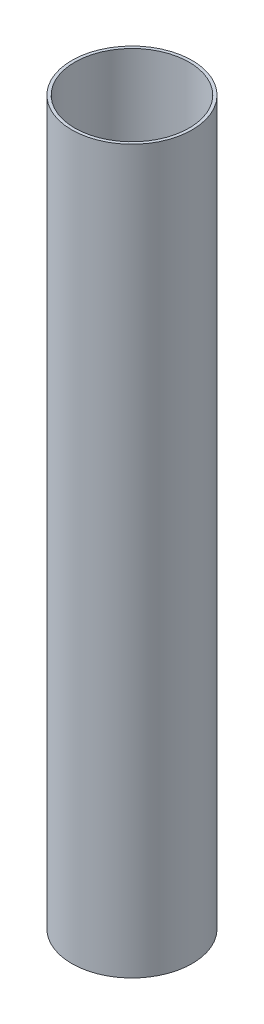
ISO-10303-21;
HEADER;
FILE_DESCRIPTION(('STEP AP214'),'2;1');
FILE_NAME('part.step','',(''),(''),'','','');
FILE_SCHEMA(('AUTOMOTIVE_DESIGN { 1 0 10303 214 1 1 1 1 }'));
ENDSEC;
DATA;
#1=APPLICATION_CONTEXT('core data for automotive mechanical design processes');
#2=APPLICATION_PROTOCOL_DEFINITION('international standard','automotive_design',2000,#1);
#3=PRODUCT_CONTEXT('',#1,'mechanical');
#4=PRODUCT('Part','Part','',(#3));
#5=PRODUCT_RELATED_PRODUCT_CATEGORY('part','',(#4));
#6=PRODUCT_DEFINITION_FORMATION('','',#4);
#7=PRODUCT_DEFINITION_CONTEXT('part definition',#1,'design');
#8=PRODUCT_DEFINITION('design','',#6,#7);
#9=PRODUCT_DEFINITION_SHAPE('','',#8);
#10=(LENGTH_UNIT() NAMED_UNIT(*) SI_UNIT(.MILLI.,.METRE.));
#11=(NAMED_UNIT(*) PLANE_ANGLE_UNIT() SI_UNIT($,.RADIAN.));
#12=(NAMED_UNIT(*) SI_UNIT($,.STERADIAN.) SOLID_ANGLE_UNIT());
#13=UNCERTAINTY_MEASURE_WITH_UNIT(LENGTH_MEASURE(1.E-05),#10,'distance_accuracy_value','');
#14=(GEOMETRIC_REPRESENTATION_CONTEXT(3) GLOBAL_UNCERTAINTY_ASSIGNED_CONTEXT((#13)) GLOBAL_UNIT_ASSIGNED_CONTEXT((#10,
#11,#12)) REPRESENTATION_CONTEXT('',''));
#15=CARTESIAN_POINT('',(0.,0.,0.));
#16=DIRECTION('',(0.,0.,1.));
#17=DIRECTION('',(1.,0.,0.));
#18=AXIS2_PLACEMENT_3D('',#15,#16,#17);
#19=CARTESIAN_POINT('',(-60.3250000000002,762.,0.));
#20=DIRECTION('',(0.,1.,0.));
#21=DIRECTION('',(0.,0.,1.));
#22=AXIS2_PLACEMENT_3D('',#19,#20,#21);
#23=PLANE('',#22);
#24=CARTESIAN_POINT('',(0.,762.,0.));
#25=DIRECTION('',(0.,1.,0.));
#26=DIRECTION('',(0.,0.,1.));
#27=AXIS2_PLACEMENT_3D('',#24,#25,#26);
#28=CIRCLE('',#27,63.5000000000002);
#29=CARTESIAN_POINT('',(0.,762.,63.5000000000002));
#30=VERTEX_POINT('',#29);
#31=EDGE_CURVE('E49',#30,#30,#28,.T.);
#32=ORIENTED_EDGE('',*,*,#31,.T.);
#33=EDGE_LOOP('',(#32));
#34=FACE_BOUND('',#33,.T.);
#35=CARTESIAN_POINT('',(0.,762.,0.));
#36=DIRECTION('',(0.,1.,0.));
#37=DIRECTION('',(0.,0.,1.));
#38=AXIS2_PLACEMENT_3D('',#35,#36,#37);
#39=CIRCLE('',#38,60.3250000000002);
#40=CARTESIAN_POINT('',(0.,762.,60.3250000000002));
#41=VERTEX_POINT('',#40);
#42=EDGE_CURVE('E10',#41,#41,#39,.T.);
#43=ORIENTED_EDGE('',*,*,#42,.F.);
#44=EDGE_LOOP('',(#43));
#45=FACE_BOUND('',#44,.T.);
#46=ADVANCED_FACE('F35',(#34,#45),#23,.T.);
#47=CARTESIAN_POINT('',(0.,819.187021794204,0.));
#48=DIRECTION('',(0.,1.,0.));
#49=DIRECTION('',(0.,0.,1.));
#50=AXIS2_PLACEMENT_3D('',#47,#48,#49);
#51=CYLINDRICAL_SURFACE('',#50,60.3250000000001);
#52=ORIENTED_EDGE('',*,*,#42,.T.);
#53=EDGE_LOOP('',(#52));
#54=FACE_BOUND('',#53,.T.);
#55=CARTESIAN_POINT('',(0.,0.,0.));
#56=DIRECTION('',(0.,1.,0.));
#57=DIRECTION('',(0.,0.,1.));
#58=AXIS2_PLACEMENT_3D('',#55,#56,#57);
#59=CIRCLE('',#58,60.3250000000001);
#60=CARTESIAN_POINT('',(0.,0.,60.3250000000001));
#61=VERTEX_POINT('',#60);
#62=EDGE_CURVE('E41',#61,#61,#59,.T.);
#63=ORIENTED_EDGE('',*,*,#62,.F.);
#64=EDGE_LOOP('',(#63));
#65=FACE_BOUND('',#64,.T.);
#66=ADVANCED_FACE('F65',(#54,#65),#51,.F.);
#67=CARTESIAN_POINT('',(-60.3250000000001,0.,0.));
#68=DIRECTION('',(0.,-1.,0.));
#69=DIRECTION('',(0.,0.,-1.));
#70=AXIS2_PLACEMENT_3D('',#67,#68,#69);
#71=PLANE('',#70);
#72=ORIENTED_EDGE('',*,*,#62,.T.);
#73=EDGE_LOOP('',(#72));
#74=FACE_BOUND('',#73,.T.);
#75=CARTESIAN_POINT('',(0.,0.,0.));
#76=DIRECTION('',(0.,1.,0.));
#77=DIRECTION('',(0.,0.,1.));
#78=AXIS2_PLACEMENT_3D('',#75,#76,#77);
#79=CIRCLE('',#78,63.5);
#80=CARTESIAN_POINT('',(0.,0.,63.5));
#81=VERTEX_POINT('',#80);
#82=EDGE_CURVE('E45',#81,#81,#79,.T.);
#83=ORIENTED_EDGE('',*,*,#82,.F.);
#84=EDGE_LOOP('',(#83));
#85=FACE_BOUND('',#84,.T.);
#86=ADVANCED_FACE('F59',(#74,#85),#71,.T.);
#87=CARTESIAN_POINT('',(0.,819.187021794204,0.));
#88=DIRECTION('',(0.,1.,0.));
#89=DIRECTION('',(0.,0.,1.));
#90=AXIS2_PLACEMENT_3D('',#87,#88,#89);
#91=CYLINDRICAL_SURFACE('',#90,63.5000000000001);
#92=ORIENTED_EDGE('',*,*,#82,.T.);
#93=EDGE_LOOP('',(#92));
#94=FACE_BOUND('',#93,.T.);
#95=ORIENTED_EDGE('',*,*,#31,.F.);
#96=EDGE_LOOP('',(#95));
#97=FACE_BOUND('',#96,.T.);
#98=ADVANCED_FACE('F57',(#94,#97),#91,.T.);
#99=CLOSED_SHELL('',(#46,#66,#86,#98));
#100=MANIFOLD_SOLID_BREP('B2',#99);
#101=ADVANCED_BREP_SHAPE_REPRESENTATION('',(#18,#100),#14);
#102=SHAPE_DEFINITION_REPRESENTATION(#9,#101);
ENDSEC;
END-ISO-10303-21;
